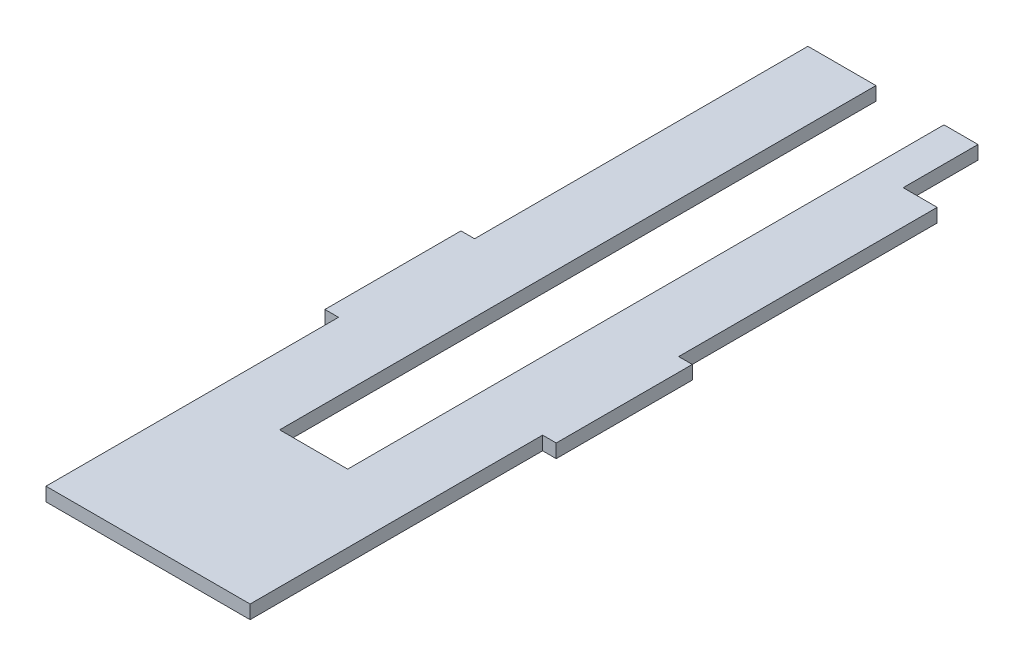
ISO-10303-21;
HEADER;
FILE_DESCRIPTION(('STEP AP214'),'2;1');
FILE_NAME('part.step','',(''),(''),'','','');
FILE_SCHEMA(('AUTOMOTIVE_DESIGN { 1 0 10303 214 1 1 1 1 }'));
ENDSEC;
DATA;
#1=APPLICATION_CONTEXT('core data for automotive mechanical design processes');
#2=APPLICATION_PROTOCOL_DEFINITION('international standard','automotive_design',2000,#1);
#3=PRODUCT_CONTEXT('',#1,'mechanical');
#4=PRODUCT('Part','Part','',(#3));
#5=PRODUCT_RELATED_PRODUCT_CATEGORY('part','',(#4));
#6=PRODUCT_DEFINITION_FORMATION('','',#4);
#7=PRODUCT_DEFINITION_CONTEXT('part definition',#1,'design');
#8=PRODUCT_DEFINITION('design','',#6,#7);
#9=PRODUCT_DEFINITION_SHAPE('','',#8);
#10=(LENGTH_UNIT() NAMED_UNIT(*) SI_UNIT(.MILLI.,.METRE.));
#11=(NAMED_UNIT(*) PLANE_ANGLE_UNIT() SI_UNIT($,.RADIAN.));
#12=(NAMED_UNIT(*) SI_UNIT($,.STERADIAN.) SOLID_ANGLE_UNIT());
#13=UNCERTAINTY_MEASURE_WITH_UNIT(LENGTH_MEASURE(1.E-05),#10,'distance_accuracy_value','');
#14=(GEOMETRIC_REPRESENTATION_CONTEXT(3) GLOBAL_UNCERTAINTY_ASSIGNED_CONTEXT((#13)) GLOBAL_UNIT_ASSIGNED_CONTEXT((#10,
#11,#12)) REPRESENTATION_CONTEXT('',''));
#15=CARTESIAN_POINT('',(0.,0.,0.));
#16=DIRECTION('',(0.,0.,1.));
#17=DIRECTION('',(1.,0.,0.));
#18=AXIS2_PLACEMENT_3D('',#15,#16,#17);
#19=CARTESIAN_POINT('',(-75.,10.,-215.));
#20=DIRECTION('',(0.,0.,-1.));
#21=DIRECTION('',(-1.,0.,0.));
#22=AXIS2_PLACEMENT_3D('',#19,#20,#21);
#23=PLANE('',#22);
#24=DIRECTION('',(1.,0.,0.));
#25=VECTOR('',#24,1.);
#26=CARTESIAN_POINT('',(-75.,0.,-215.));
#27=LINE('',#26,#25);
#28=CARTESIAN_POINT('',(-85.,0.,-215.));
#29=VERTEX_POINT('',#28);
#30=CARTESIAN_POINT('',(-75.,0.,-215.));
#31=VERTEX_POINT('',#30);
#32=EDGE_CURVE('E191',#29,#31,#27,.T.);
#33=ORIENTED_EDGE('',*,*,#32,.T.);
#34=DIRECTION('',(0.,-1.,0.));
#35=VECTOR('',#34,1.);
#36=CARTESIAN_POINT('',(-75.,10.,-215.));
#37=LINE('',#36,#35);
#38=CARTESIAN_POINT('',(-75.,10.,-215.));
#39=VERTEX_POINT('',#38);
#40=EDGE_CURVE('E11',#39,#31,#37,.T.);
#41=ORIENTED_EDGE('',*,*,#40,.F.);
#42=DIRECTION('',(1.,0.,0.));
#43=VECTOR('',#42,1.);
#44=CARTESIAN_POINT('',(-75.,10.,-215.));
#45=LINE('',#44,#43);
#46=CARTESIAN_POINT('',(-85.,10.,-215.));
#47=VERTEX_POINT('',#46);
#48=EDGE_CURVE('E224',#47,#39,#45,.T.);
#49=ORIENTED_EDGE('',*,*,#48,.F.);
#50=DIRECTION('',(0.,-1.,0.));
#51=VECTOR('',#50,1.);
#52=CARTESIAN_POINT('',(-85.,10.,-215.));
#53=LINE('',#52,#51);
#54=EDGE_CURVE('E187',#47,#29,#53,.T.);
#55=ORIENTED_EDGE('',*,*,#54,.T.);
#56=EDGE_LOOP('',(#33,#41,#49,#55));
#57=FACE_BOUND('',#56,.T.);
#58=ADVANCED_FACE('F40',(#57),#23,.F.);
#59=CARTESIAN_POINT('',(-75.,10.,-215.));
#60=DIRECTION('',(1.,0.,0.));
#61=DIRECTION('',(0.,0.,-1.));
#62=AXIS2_PLACEMENT_3D('',#59,#60,#61);
#63=PLANE('',#62);
#64=DIRECTION('',(0.,0.,1.));
#65=VECTOR('',#64,1.);
#66=CARTESIAN_POINT('',(-75.,0.,-215.));
#67=LINE('',#66,#65);
#68=CARTESIAN_POINT('',(-75.,0.,0.));
#69=VERTEX_POINT('',#68);
#70=EDGE_CURVE('E194',#31,#69,#67,.T.);
#71=ORIENTED_EDGE('',*,*,#70,.T.);
#72=DIRECTION('',(0.,-1.,0.));
#73=VECTOR('',#72,1.);
#74=CARTESIAN_POINT('',(-75.,10.,0.));
#75=LINE('',#74,#73);
#76=CARTESIAN_POINT('',(-75.,10.,0.));
#77=VERTEX_POINT('',#76);
#78=EDGE_CURVE('E47',#77,#69,#75,.T.);
#79=ORIENTED_EDGE('',*,*,#78,.F.);
#80=DIRECTION('',(0.,0.,1.));
#81=VECTOR('',#80,1.);
#82=CARTESIAN_POINT('',(-75.,10.,-215.));
#83=LINE('',#82,#81);
#84=EDGE_CURVE('E125',#39,#77,#83,.T.);
#85=ORIENTED_EDGE('',*,*,#84,.F.);
#86=ORIENTED_EDGE('',*,*,#40,.T.);
#87=EDGE_LOOP('',(#71,#79,#85,#86));
#88=FACE_BOUND('',#87,.T.);
#89=ADVANCED_FACE('F370',(#88),#63,.F.);
#90=CARTESIAN_POINT('',(-75.,10.,0.));
#91=DIRECTION('',(0.,0.,-1.));
#92=DIRECTION('',(-1.,0.,0.));
#93=AXIS2_PLACEMENT_3D('',#90,#91,#92);
#94=PLANE('',#93);
#95=DIRECTION('',(1.,0.,0.));
#96=VECTOR('',#95,1.);
#97=CARTESIAN_POINT('',(-75.,0.,0.));
#98=LINE('',#97,#96);
#99=CARTESIAN_POINT('',(75.,0.,0.));
#100=VERTEX_POINT('',#99);
#101=EDGE_CURVE('E197',#69,#100,#98,.T.);
#102=ORIENTED_EDGE('',*,*,#101,.T.);
#103=DIRECTION('',(0.,-1.,0.));
#104=VECTOR('',#103,1.);
#105=CARTESIAN_POINT('',(75.,10.,0.));
#106=LINE('',#105,#104);
#107=CARTESIAN_POINT('',(75.,10.,0.));
#108=VERTEX_POINT('',#107);
#109=EDGE_CURVE('E252',#108,#100,#106,.T.);
#110=ORIENTED_EDGE('',*,*,#109,.F.);
#111=DIRECTION('',(1.,0.,0.));
#112=VECTOR('',#111,1.);
#113=CARTESIAN_POINT('',(-75.,10.,0.));
#114=LINE('',#113,#112);
#115=EDGE_CURVE('E260',#77,#108,#114,.T.);
#116=ORIENTED_EDGE('',*,*,#115,.F.);
#117=ORIENTED_EDGE('',*,*,#78,.T.);
#118=EDGE_LOOP('',(#102,#110,#116,#117));
#119=FACE_BOUND('',#118,.T.);
#120=ADVANCED_FACE('F258',(#119),#94,.F.);
#121=CARTESIAN_POINT('',(75.,10.,-215.));
#122=DIRECTION('',(-1.,0.,0.));
#123=DIRECTION('',(0.,0.,1.));
#124=AXIS2_PLACEMENT_3D('',#121,#122,#123);
#125=PLANE('',#124);
#126=DIRECTION('',(0.,0.,-1.));
#127=VECTOR('',#126,1.);
#128=CARTESIAN_POINT('',(75.,0.,-215.));
#129=LINE('',#128,#127);
#130=CARTESIAN_POINT('',(75.,0.,-215.));
#131=VERTEX_POINT('',#130);
#132=EDGE_CURVE('E199',#100,#131,#129,.T.);
#133=ORIENTED_EDGE('',*,*,#132,.T.);
#134=DIRECTION('',(0.,-1.,0.));
#135=VECTOR('',#134,1.);
#136=CARTESIAN_POINT('',(75.,10.,-215.));
#137=LINE('',#136,#135);
#138=CARTESIAN_POINT('',(75.,10.,-215.));
#139=VERTEX_POINT('',#138);
#140=EDGE_CURVE('E249',#139,#131,#137,.T.);
#141=ORIENTED_EDGE('',*,*,#140,.F.);
#142=DIRECTION('',(0.,0.,-1.));
#143=VECTOR('',#142,1.);
#144=CARTESIAN_POINT('',(75.,10.,-215.));
#145=LINE('',#144,#143);
#146=EDGE_CURVE('E278',#108,#139,#145,.T.);
#147=ORIENTED_EDGE('',*,*,#146,.F.);
#148=ORIENTED_EDGE('',*,*,#109,.T.);
#149=EDGE_LOOP('',(#133,#141,#147,#148));
#150=FACE_BOUND('',#149,.T.);
#151=ADVANCED_FACE('F269',(#150),#125,.F.);
#152=CARTESIAN_POINT('',(75.,10.,-215.));
#153=DIRECTION('',(0.,0.,-1.));
#154=DIRECTION('',(-1.,0.,0.));
#155=AXIS2_PLACEMENT_3D('',#152,#153,#154);
#156=PLANE('',#155);
#157=DIRECTION('',(1.,0.,0.));
#158=VECTOR('',#157,1.);
#159=CARTESIAN_POINT('',(75.,0.,-215.));
#160=LINE('',#159,#158);
#161=CARTESIAN_POINT('',(85.,0.,-215.));
#162=VERTEX_POINT('',#161);
#163=EDGE_CURVE('E201',#131,#162,#160,.T.);
#164=ORIENTED_EDGE('',*,*,#163,.T.);
#165=DIRECTION('',(0.,-1.,0.));
#166=VECTOR('',#165,1.);
#167=CARTESIAN_POINT('',(85.,10.,-215.));
#168=LINE('',#167,#166);
#169=CARTESIAN_POINT('',(85.,10.,-215.));
#170=VERTEX_POINT('',#169);
#171=EDGE_CURVE('E246',#170,#162,#168,.T.);
#172=ORIENTED_EDGE('',*,*,#171,.F.);
#173=DIRECTION('',(1.,0.,0.));
#174=VECTOR('',#173,1.);
#175=CARTESIAN_POINT('',(75.,10.,-215.));
#176=LINE('',#175,#174);
#177=EDGE_CURVE('E275',#139,#170,#176,.T.);
#178=ORIENTED_EDGE('',*,*,#177,.F.);
#179=ORIENTED_EDGE('',*,*,#140,.T.);
#180=EDGE_LOOP('',(#164,#172,#178,#179));
#181=FACE_BOUND('',#180,.T.);
#182=ADVANCED_FACE('F273',(#181),#156,.F.);
#183=CARTESIAN_POINT('',(85.,10.,-215.));
#184=DIRECTION('',(-1.,0.,0.));
#185=DIRECTION('',(0.,0.,1.));
#186=AXIS2_PLACEMENT_3D('',#183,#184,#185);
#187=PLANE('',#186);
#188=DIRECTION('',(0.,0.,-1.));
#189=VECTOR('',#188,1.);
#190=CARTESIAN_POINT('',(85.,0.,-215.));
#191=LINE('',#190,#189);
#192=CARTESIAN_POINT('',(85.,0.,-315.));
#193=VERTEX_POINT('',#192);
#194=EDGE_CURVE('E203',#162,#193,#191,.T.);
#195=ORIENTED_EDGE('',*,*,#194,.T.);
#196=DIRECTION('',(0.,-1.,0.));
#197=VECTOR('',#196,1.);
#198=CARTESIAN_POINT('',(85.,10.,-315.));
#199=LINE('',#198,#197);
#200=CARTESIAN_POINT('',(85.,10.,-315.));
#201=VERTEX_POINT('',#200);
#202=EDGE_CURVE('E243',#201,#193,#199,.T.);
#203=ORIENTED_EDGE('',*,*,#202,.F.);
#204=DIRECTION('',(0.,0.,-1.));
#205=VECTOR('',#204,1.);
#206=CARTESIAN_POINT('',(85.,10.,-215.));
#207=LINE('',#206,#205);
#208=EDGE_CURVE('E277',#170,#201,#207,.T.);
#209=ORIENTED_EDGE('',*,*,#208,.F.);
#210=ORIENTED_EDGE('',*,*,#171,.T.);
#211=EDGE_LOOP('',(#195,#203,#209,#210));
#212=FACE_BOUND('',#211,.T.);
#213=ADVANCED_FACE('F360',(#212),#187,.F.);
#214=CARTESIAN_POINT('',(85.,10.,-315.));
#215=DIRECTION('',(0.,0.,1.));
#216=DIRECTION('',(1.,0.,0.));
#217=AXIS2_PLACEMENT_3D('',#214,#215,#216);
#218=PLANE('',#217);
#219=DIRECTION('',(-1.,0.,0.));
#220=VECTOR('',#219,1.);
#221=CARTESIAN_POINT('',(85.,0.,-315.));
#222=LINE('',#221,#220);
#223=CARTESIAN_POINT('',(75.,0.,-315.));
#224=VERTEX_POINT('',#223);
#225=EDGE_CURVE('E205',#193,#224,#222,.T.);
#226=ORIENTED_EDGE('',*,*,#225,.T.);
#227=DIRECTION('',(0.,-1.,0.));
#228=VECTOR('',#227,1.);
#229=CARTESIAN_POINT('',(75.,10.,-315.));
#230=LINE('',#229,#228);
#231=CARTESIAN_POINT('',(75.,10.,-315.));
#232=VERTEX_POINT('',#231);
#233=EDGE_CURVE('E240',#232,#224,#230,.T.);
#234=ORIENTED_EDGE('',*,*,#233,.F.);
#235=DIRECTION('',(-1.,0.,0.));
#236=VECTOR('',#235,1.);
#237=CARTESIAN_POINT('',(85.,10.,-315.));
#238=LINE('',#237,#236);
#239=EDGE_CURVE('E280',#201,#232,#238,.T.);
#240=ORIENTED_EDGE('',*,*,#239,.F.);
#241=ORIENTED_EDGE('',*,*,#202,.T.);
#242=EDGE_LOOP('',(#226,#234,#240,#241));
#243=FACE_BOUND('',#242,.T.);
#244=ADVANCED_FACE('F357',(#243),#218,.F.);
#245=CARTESIAN_POINT('',(75.,10.,-315.));
#246=DIRECTION('',(-1.,0.,0.));
#247=DIRECTION('',(0.,0.,1.));
#248=AXIS2_PLACEMENT_3D('',#245,#246,#247);
#249=PLANE('',#248);
#250=DIRECTION('',(0.,0.,-1.));
#251=VECTOR('',#250,1.);
#252=CARTESIAN_POINT('',(75.,0.,-315.));
#253=LINE('',#252,#251);
#254=CARTESIAN_POINT('',(75.,0.,-505.));
#255=VERTEX_POINT('',#254);
#256=EDGE_CURVE('E207',#224,#255,#253,.T.);
#257=ORIENTED_EDGE('',*,*,#256,.T.);
#258=DIRECTION('',(0.,1.,0.));
#259=VECTOR('',#258,1.);
#260=CARTESIAN_POINT('',(75.,0.,-505.));
#261=LINE('',#260,#259);
#262=CARTESIAN_POINT('',(75.,10.,-505.));
#263=VERTEX_POINT('',#262);
#264=EDGE_CURVE('E195',#255,#263,#261,.T.);
#265=ORIENTED_EDGE('',*,*,#264,.T.);
#266=DIRECTION('',(0.,0.,-1.));
#267=VECTOR('',#266,1.);
#268=CARTESIAN_POINT('',(75.,10.,-315.));
#269=LINE('',#268,#267);
#270=EDGE_CURVE('E286',#232,#263,#269,.T.);
#271=ORIENTED_EDGE('',*,*,#270,.F.);
#272=ORIENTED_EDGE('',*,*,#233,.T.);
#273=EDGE_LOOP('',(#257,#265,#271,#272));
#274=FACE_BOUND('',#273,.T.);
#275=ADVANCED_FACE('F352',(#274),#249,.F.);
#276=CARTESIAN_POINT('',(25.,10.,-560.));
#277=DIRECTION('',(0.,0.,1.));
#278=DIRECTION('',(1.,0.,0.));
#279=AXIS2_PLACEMENT_3D('',#276,#277,#278);
#280=PLANE('',#279);
#281=DIRECTION('',(-1.,0.,0.));
#282=VECTOR('',#281,1.);
#283=CARTESIAN_POINT('',(25.,10.,-560.));
#284=LINE('',#283,#282);
#285=CARTESIAN_POINT('',(50.,10.,-560.));
#286=VERTEX_POINT('',#285);
#287=CARTESIAN_POINT('',(25.,10.,-560.));
#288=VERTEX_POINT('',#287);
#289=EDGE_CURVE('E288',#286,#288,#284,.T.);
#290=ORIENTED_EDGE('',*,*,#289,.F.);
#291=DIRECTION('',(0.,1.,0.));
#292=VECTOR('',#291,1.);
#293=CARTESIAN_POINT('',(50.,0.,-560.));
#294=LINE('',#293,#292);
#295=CARTESIAN_POINT('',(50.,0.,-560.));
#296=VERTEX_POINT('',#295);
#297=EDGE_CURVE('E312',#296,#286,#294,.T.);
#298=ORIENTED_EDGE('',*,*,#297,.F.);
#299=DIRECTION('',(-1.,0.,0.));
#300=VECTOR('',#299,1.);
#301=CARTESIAN_POINT('',(25.,0.,-560.));
#302=LINE('',#301,#300);
#303=CARTESIAN_POINT('',(25.,0.,-560.));
#304=VERTEX_POINT('',#303);
#305=EDGE_CURVE('E210',#296,#304,#302,.T.);
#306=ORIENTED_EDGE('',*,*,#305,.T.);
#307=DIRECTION('',(0.,-1.,0.));
#308=VECTOR('',#307,1.);
#309=CARTESIAN_POINT('',(25.,10.,-560.));
#310=LINE('',#309,#308);
#311=EDGE_CURVE('E237',#288,#304,#310,.T.);
#312=ORIENTED_EDGE('',*,*,#311,.F.);
#313=EDGE_LOOP('',(#290,#298,#306,#312));
#314=FACE_BOUND('',#313,.T.);
#315=ADVANCED_FACE('F341',(#314),#280,.F.);
#316=CARTESIAN_POINT('',(25.,10.,-560.));
#317=DIRECTION('',(1.,0.,0.));
#318=DIRECTION('',(0.,0.,-1.));
#319=AXIS2_PLACEMENT_3D('',#316,#317,#318);
#320=PLANE('',#319);
#321=DIRECTION('',(0.,0.,1.));
#322=VECTOR('',#321,1.);
#323=CARTESIAN_POINT('',(25.,0.,-560.));
#324=LINE('',#323,#322);
#325=CARTESIAN_POINT('',(25.,0.,-121.727049474025));
#326=VERTEX_POINT('',#325);
#327=EDGE_CURVE('E212',#304,#326,#324,.T.);
#328=ORIENTED_EDGE('',*,*,#327,.T.);
#329=DIRECTION('',(0.,-1.,0.));
#330=VECTOR('',#329,1.);
#331=CARTESIAN_POINT('',(25.,10.,-121.727049474025));
#332=LINE('',#331,#330);
#333=CARTESIAN_POINT('',(25.,10.,-121.727049474025));
#334=VERTEX_POINT('',#333);
#335=EDGE_CURVE('E234',#334,#326,#332,.T.);
#336=ORIENTED_EDGE('',*,*,#335,.F.);
#337=DIRECTION('',(0.,0.,1.));
#338=VECTOR('',#337,1.);
#339=CARTESIAN_POINT('',(25.,10.,-560.));
#340=LINE('',#339,#338);
#341=EDGE_CURVE('E290',#288,#334,#340,.T.);
#342=ORIENTED_EDGE('',*,*,#341,.F.);
#343=ORIENTED_EDGE('',*,*,#311,.T.);
#344=EDGE_LOOP('',(#328,#336,#342,#343));
#345=FACE_BOUND('',#344,.T.);
#346=ADVANCED_FACE('F405',(#345),#320,.F.);
#347=CARTESIAN_POINT('',(-25.,10.,-121.727049474025));
#348=DIRECTION('',(0.,0.,1.));
#349=DIRECTION('',(1.,0.,0.));
#350=AXIS2_PLACEMENT_3D('',#347,#348,#349);
#351=PLANE('',#350);
#352=DIRECTION('',(-1.,0.,0.));
#353=VECTOR('',#352,1.);
#354=CARTESIAN_POINT('',(-25.,0.,-121.727049474025));
#355=LINE('',#354,#353);
#356=CARTESIAN_POINT('',(-25.,0.,-121.727049474025));
#357=VERTEX_POINT('',#356);
#358=EDGE_CURVE('E214',#326,#357,#355,.T.);
#359=ORIENTED_EDGE('',*,*,#358,.T.);
#360=DIRECTION('',(0.,-1.,0.));
#361=VECTOR('',#360,1.);
#362=CARTESIAN_POINT('',(-25.,10.,-121.727049474025));
#363=LINE('',#362,#361);
#364=CARTESIAN_POINT('',(-25.,10.,-121.727049474025));
#365=VERTEX_POINT('',#364);
#366=EDGE_CURVE('E231',#365,#357,#363,.T.);
#367=ORIENTED_EDGE('',*,*,#366,.F.);
#368=DIRECTION('',(-1.,0.,0.));
#369=VECTOR('',#368,1.);
#370=CARTESIAN_POINT('',(-25.,10.,-121.727049474025));
#371=LINE('',#370,#369);
#372=EDGE_CURVE('E292',#334,#365,#371,.T.);
#373=ORIENTED_EDGE('',*,*,#372,.F.);
#374=ORIENTED_EDGE('',*,*,#335,.T.);
#375=EDGE_LOOP('',(#359,#367,#373,#374));
#376=FACE_BOUND('',#375,.T.);
#377=ADVANCED_FACE('F410',(#376),#351,.F.);
#378=CARTESIAN_POINT('',(-25.,10.,-560.));
#379=DIRECTION('',(-1.,0.,0.));
#380=DIRECTION('',(0.,0.,1.));
#381=AXIS2_PLACEMENT_3D('',#378,#379,#380);
#382=PLANE('',#381);
#383=DIRECTION('',(0.,0.,-1.));
#384=VECTOR('',#383,1.);
#385=CARTESIAN_POINT('',(-25.,0.,-560.));
#386=LINE('',#385,#384);
#387=CARTESIAN_POINT('',(-25.,0.,-560.));
#388=VERTEX_POINT('',#387);
#389=EDGE_CURVE('E216',#357,#388,#386,.T.);
#390=ORIENTED_EDGE('',*,*,#389,.T.);
#391=DIRECTION('',(0.,-1.,0.));
#392=VECTOR('',#391,1.);
#393=CARTESIAN_POINT('',(-25.,10.,-560.));
#394=LINE('',#393,#392);
#395=CARTESIAN_POINT('',(-25.,10.,-560.));
#396=VERTEX_POINT('',#395);
#397=EDGE_CURVE('E228',#396,#388,#394,.T.);
#398=ORIENTED_EDGE('',*,*,#397,.F.);
#399=DIRECTION('',(0.,0.,-1.));
#400=VECTOR('',#399,1.);
#401=CARTESIAN_POINT('',(-25.,10.,-560.));
#402=LINE('',#401,#400);
#403=EDGE_CURVE('E294',#365,#396,#402,.T.);
#404=ORIENTED_EDGE('',*,*,#403,.F.);
#405=ORIENTED_EDGE('',*,*,#366,.T.);
#406=EDGE_LOOP('',(#390,#398,#404,#405));
#407=FACE_BOUND('',#406,.T.);
#408=ADVANCED_FACE('F300',(#407),#382,.F.);
#409=CARTESIAN_POINT('',(-75.,10.,-560.));
#410=DIRECTION('',(0.,0.,1.));
#411=DIRECTION('',(1.,0.,0.));
#412=AXIS2_PLACEMENT_3D('',#409,#410,#411);
#413=PLANE('',#412);
#414=DIRECTION('',(-1.,0.,0.));
#415=VECTOR('',#414,1.);
#416=CARTESIAN_POINT('',(-75.,0.,-560.));
#417=LINE('',#416,#415);
#418=CARTESIAN_POINT('',(-75.,0.,-560.));
#419=VERTEX_POINT('',#418);
#420=EDGE_CURVE('E218',#388,#419,#417,.T.);
#421=ORIENTED_EDGE('',*,*,#420,.T.);
#422=DIRECTION('',(0.,-1.,0.));
#423=VECTOR('',#422,1.);
#424=CARTESIAN_POINT('',(-75.,10.,-560.));
#425=LINE('',#424,#423);
#426=CARTESIAN_POINT('',(-75.,10.,-560.));
#427=VERTEX_POINT('',#426);
#428=EDGE_CURVE('E182',#427,#419,#425,.T.);
#429=ORIENTED_EDGE('',*,*,#428,.F.);
#430=DIRECTION('',(-1.,0.,0.));
#431=VECTOR('',#430,1.);
#432=CARTESIAN_POINT('',(-75.,10.,-560.));
#433=LINE('',#432,#431);
#434=EDGE_CURVE('E170',#396,#427,#433,.T.);
#435=ORIENTED_EDGE('',*,*,#434,.F.);
#436=ORIENTED_EDGE('',*,*,#397,.T.);
#437=EDGE_LOOP('',(#421,#429,#435,#436));
#438=FACE_BOUND('',#437,.T.);
#439=ADVANCED_FACE('F304',(#438),#413,.F.);
#440=CARTESIAN_POINT('',(-75.,10.,-315.));
#441=DIRECTION('',(1.,0.,0.));
#442=DIRECTION('',(0.,0.,-1.));
#443=AXIS2_PLACEMENT_3D('',#440,#441,#442);
#444=PLANE('',#443);
#445=DIRECTION('',(0.,0.,1.));
#446=VECTOR('',#445,1.);
#447=CARTESIAN_POINT('',(-75.,0.,-315.));
#448=LINE('',#447,#446);
#449=CARTESIAN_POINT('',(-75.,0.,-315.));
#450=VERTEX_POINT('',#449);
#451=EDGE_CURVE('E179',#419,#450,#448,.T.);
#452=ORIENTED_EDGE('',*,*,#451,.T.);
#453=DIRECTION('',(0.,-1.,0.));
#454=VECTOR('',#453,1.);
#455=CARTESIAN_POINT('',(-75.,10.,-315.));
#456=LINE('',#455,#454);
#457=CARTESIAN_POINT('',(-75.,10.,-315.));
#458=VERTEX_POINT('',#457);
#459=EDGE_CURVE('E176',#458,#450,#456,.T.);
#460=ORIENTED_EDGE('',*,*,#459,.F.);
#461=DIRECTION('',(0.,0.,1.));
#462=VECTOR('',#461,1.);
#463=CARTESIAN_POINT('',(-75.,10.,-315.));
#464=LINE('',#463,#462);
#465=EDGE_CURVE('E162',#427,#458,#464,.T.);
#466=ORIENTED_EDGE('',*,*,#465,.F.);
#467=ORIENTED_EDGE('',*,*,#428,.T.);
#468=EDGE_LOOP('',(#452,#460,#466,#467));
#469=FACE_BOUND('',#468,.T.);
#470=ADVANCED_FACE('F177',(#469),#444,.F.);
#471=CARTESIAN_POINT('',(-85.,10.,-315.));
#472=DIRECTION('',(0.,0.,1.));
#473=DIRECTION('',(1.,0.,0.));
#474=AXIS2_PLACEMENT_3D('',#471,#472,#473);
#475=PLANE('',#474);
#476=DIRECTION('',(-1.,0.,0.));
#477=VECTOR('',#476,1.);
#478=CARTESIAN_POINT('',(-85.,0.,-315.));
#479=LINE('',#478,#477);
#480=CARTESIAN_POINT('',(-85.,0.,-315.));
#481=VERTEX_POINT('',#480);
#482=EDGE_CURVE('E221',#450,#481,#479,.T.);
#483=ORIENTED_EDGE('',*,*,#482,.T.);
#484=DIRECTION('',(0.,-1.,0.));
#485=VECTOR('',#484,1.);
#486=CARTESIAN_POINT('',(-85.,10.,-315.));
#487=LINE('',#486,#485);
#488=CARTESIAN_POINT('',(-85.,10.,-315.));
#489=VERTEX_POINT('',#488);
#490=EDGE_CURVE('E183',#489,#481,#487,.T.);
#491=ORIENTED_EDGE('',*,*,#490,.F.);
#492=DIRECTION('',(-1.,0.,0.));
#493=VECTOR('',#492,1.);
#494=CARTESIAN_POINT('',(-85.,10.,-315.));
#495=LINE('',#494,#493);
#496=EDGE_CURVE('E167',#458,#489,#495,.T.);
#497=ORIENTED_EDGE('',*,*,#496,.F.);
#498=ORIENTED_EDGE('',*,*,#459,.T.);
#499=EDGE_LOOP('',(#483,#491,#497,#498));
#500=FACE_BOUND('',#499,.T.);
#501=ADVANCED_FACE('F185',(#500),#475,.F.);
#502=CARTESIAN_POINT('',(-85.,10.,-215.));
#503=DIRECTION('',(1.,0.,0.));
#504=DIRECTION('',(0.,0.,-1.));
#505=AXIS2_PLACEMENT_3D('',#502,#503,#504);
#506=PLANE('',#505);
#507=DIRECTION('',(0.,0.,1.));
#508=VECTOR('',#507,1.);
#509=CARTESIAN_POINT('',(-85.,0.,-215.));
#510=LINE('',#509,#508);
#511=EDGE_CURVE('E117',#481,#29,#510,.T.);
#512=ORIENTED_EDGE('',*,*,#511,.T.);
#513=ORIENTED_EDGE('',*,*,#54,.F.);
#514=DIRECTION('',(0.,0.,1.));
#515=VECTOR('',#514,1.);
#516=CARTESIAN_POINT('',(-85.,10.,-215.));
#517=LINE('',#516,#515);
#518=EDGE_CURVE('E63',#489,#47,#517,.T.);
#519=ORIENTED_EDGE('',*,*,#518,.F.);
#520=ORIENTED_EDGE('',*,*,#490,.T.);
#521=EDGE_LOOP('',(#512,#513,#519,#520));
#522=FACE_BOUND('',#521,.T.);
#523=ADVANCED_FACE('F305',(#522),#506,.F.);
#524=CARTESIAN_POINT('',(0.,10.,0.));
#525=DIRECTION('',(0.,-1.,0.));
#526=DIRECTION('',(0.,0.,-1.));
#527=AXIS2_PLACEMENT_3D('',#524,#525,#526);
#528=PLANE('',#527);
#529=ORIENTED_EDGE('',*,*,#270,.T.);
#530=DIRECTION('',(1.,0.,0.));
#531=VECTOR('',#530,1.);
#532=CARTESIAN_POINT('',(75.,10.,-505.));
#533=LINE('',#532,#531);
#534=CARTESIAN_POINT('',(50.,10.,-505.));
#535=VERTEX_POINT('',#534);
#536=EDGE_CURVE('E319',#535,#263,#533,.T.);
#537=ORIENTED_EDGE('',*,*,#536,.F.);
#538=DIRECTION('',(0.,0.,1.));
#539=VECTOR('',#538,1.);
#540=CARTESIAN_POINT('',(50.,10.,-560.));
#541=LINE('',#540,#539);
#542=EDGE_CURVE('E323',#286,#535,#541,.T.);
#543=ORIENTED_EDGE('',*,*,#542,.F.);
#544=ORIENTED_EDGE('',*,*,#289,.T.);
#545=ORIENTED_EDGE('',*,*,#341,.T.);
#546=ORIENTED_EDGE('',*,*,#372,.T.);
#547=ORIENTED_EDGE('',*,*,#403,.T.);
#548=ORIENTED_EDGE('',*,*,#434,.T.);
#549=ORIENTED_EDGE('',*,*,#465,.T.);
#550=ORIENTED_EDGE('',*,*,#496,.T.);
#551=ORIENTED_EDGE('',*,*,#518,.T.);
#552=ORIENTED_EDGE('',*,*,#48,.T.);
#553=ORIENTED_EDGE('',*,*,#84,.T.);
#554=ORIENTED_EDGE('',*,*,#115,.T.);
#555=ORIENTED_EDGE('',*,*,#146,.T.);
#556=ORIENTED_EDGE('',*,*,#177,.T.);
#557=ORIENTED_EDGE('',*,*,#208,.T.);
#558=ORIENTED_EDGE('',*,*,#239,.T.);
#559=EDGE_LOOP('',(#529,#537,#543,#544,#545,#546,#547,#548,#549,#550,#551,#552,#553,#554,#555,
#556,#557,#558));
#560=FACE_BOUND('',#559,.T.);
#561=ADVANCED_FACE('F165',(#560),#528,.F.);
#562=CARTESIAN_POINT('',(0.,0.,0.));
#563=DIRECTION('',(0.,-1.,0.));
#564=DIRECTION('',(0.,0.,-1.));
#565=AXIS2_PLACEMENT_3D('',#562,#563,#564);
#566=PLANE('',#565);
#567=DIRECTION('',(1.,0.,0.));
#568=VECTOR('',#567,1.);
#569=CARTESIAN_POINT('',(75.,0.,-505.));
#570=LINE('',#569,#568);
#571=CARTESIAN_POINT('',(50.,0.,-505.));
#572=VERTEX_POINT('',#571);
#573=EDGE_CURVE('E54',#572,#255,#570,.T.);
#574=ORIENTED_EDGE('',*,*,#573,.T.);
#575=ORIENTED_EDGE('',*,*,#256,.F.);
#576=ORIENTED_EDGE('',*,*,#225,.F.);
#577=ORIENTED_EDGE('',*,*,#194,.F.);
#578=ORIENTED_EDGE('',*,*,#163,.F.);
#579=ORIENTED_EDGE('',*,*,#132,.F.);
#580=ORIENTED_EDGE('',*,*,#101,.F.);
#581=ORIENTED_EDGE('',*,*,#70,.F.);
#582=ORIENTED_EDGE('',*,*,#32,.F.);
#583=ORIENTED_EDGE('',*,*,#511,.F.);
#584=ORIENTED_EDGE('',*,*,#482,.F.);
#585=ORIENTED_EDGE('',*,*,#451,.F.);
#586=ORIENTED_EDGE('',*,*,#420,.F.);
#587=ORIENTED_EDGE('',*,*,#389,.F.);
#588=ORIENTED_EDGE('',*,*,#358,.F.);
#589=ORIENTED_EDGE('',*,*,#327,.F.);
#590=ORIENTED_EDGE('',*,*,#305,.F.);
#591=DIRECTION('',(0.,0.,1.));
#592=VECTOR('',#591,1.);
#593=CARTESIAN_POINT('',(50.,0.,-560.));
#594=LINE('',#593,#592);
#595=EDGE_CURVE('E322',#296,#572,#594,.T.);
#596=ORIENTED_EDGE('',*,*,#595,.T.);
#597=EDGE_LOOP('',(#574,#575,#576,#577,#578,#579,#580,#581,#582,#583,#584,#585,#586,#587,#588,
#589,#590,#596));
#598=FACE_BOUND('',#597,.T.);
#599=ADVANCED_FACE('F263',(#598),#566,.T.);
#600=CARTESIAN_POINT('',(75.,0.,-505.));
#601=DIRECTION('',(0.,0.,1.));
#602=DIRECTION('',(1.,0.,0.));
#603=AXIS2_PLACEMENT_3D('',#600,#601,#602);
#604=PLANE('',#603);
#605=ORIENTED_EDGE('',*,*,#536,.T.);
#606=ORIENTED_EDGE('',*,*,#264,.F.);
#607=ORIENTED_EDGE('',*,*,#573,.F.);
#608=DIRECTION('',(0.,1.,0.));
#609=VECTOR('',#608,1.);
#610=CARTESIAN_POINT('',(50.,0.,-505.));
#611=LINE('',#610,#609);
#612=EDGE_CURVE('E315',#572,#535,#611,.T.);
#613=ORIENTED_EDGE('',*,*,#612,.T.);
#614=EDGE_LOOP('',(#605,#606,#607,#613));
#615=FACE_BOUND('',#614,.T.);
#616=ADVANCED_FACE('F349',(#615),#604,.F.);
#617=CARTESIAN_POINT('',(50.,0.,-560.));
#618=DIRECTION('',(-1.,0.,0.));
#619=DIRECTION('',(0.,0.,1.));
#620=AXIS2_PLACEMENT_3D('',#617,#618,#619);
#621=PLANE('',#620);
#622=ORIENTED_EDGE('',*,*,#542,.T.);
#623=ORIENTED_EDGE('',*,*,#612,.F.);
#624=ORIENTED_EDGE('',*,*,#595,.F.);
#625=ORIENTED_EDGE('',*,*,#297,.T.);
#626=EDGE_LOOP('',(#622,#623,#624,#625));
#627=FACE_BOUND('',#626,.T.);
#628=ADVANCED_FACE('F335',(#627),#621,.F.);
#629=CLOSED_SHELL('',(#58,#89,#120,#151,#182,#213,#244,#275,#315,#346,#377,#408,#439,#470,#501,
#523,#561,#599,#616,#628));
#630=MANIFOLD_SOLID_BREP('B2',#629);
#631=ADVANCED_BREP_SHAPE_REPRESENTATION('',(#18,#630),#14);
#632=SHAPE_DEFINITION_REPRESENTATION(#9,#631);
ENDSEC;
END-ISO-10303-21;
